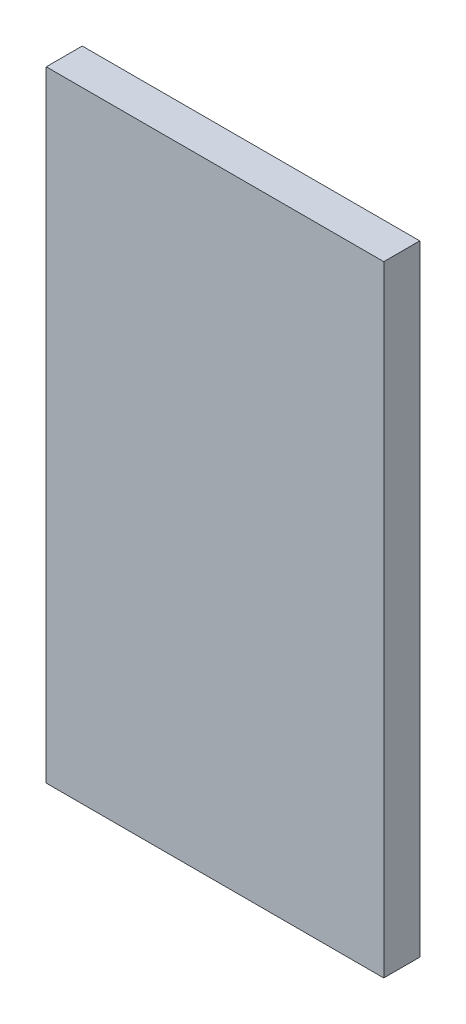
ISO-10303-21;
HEADER;
FILE_DESCRIPTION(('STEP AP214'),'2;1');
FILE_NAME('part.step','',(''),(''),'','','');
FILE_SCHEMA(('AUTOMOTIVE_DESIGN { 1 0 10303 214 1 1 1 1 }'));
ENDSEC;
DATA;
#1=APPLICATION_CONTEXT('core data for automotive mechanical design processes');
#2=APPLICATION_PROTOCOL_DEFINITION('international standard','automotive_design',2000,#1);
#3=PRODUCT_CONTEXT('',#1,'mechanical');
#4=PRODUCT('Part','Part','',(#3));
#5=PRODUCT_RELATED_PRODUCT_CATEGORY('part','',(#4));
#6=PRODUCT_DEFINITION_FORMATION('','',#4);
#7=PRODUCT_DEFINITION_CONTEXT('part definition',#1,'design');
#8=PRODUCT_DEFINITION('design','',#6,#7);
#9=PRODUCT_DEFINITION_SHAPE('','',#8);
#10=(LENGTH_UNIT() NAMED_UNIT(*) SI_UNIT(.MILLI.,.METRE.));
#11=(NAMED_UNIT(*) PLANE_ANGLE_UNIT() SI_UNIT($,.RADIAN.));
#12=(NAMED_UNIT(*) SI_UNIT($,.STERADIAN.) SOLID_ANGLE_UNIT());
#13=UNCERTAINTY_MEASURE_WITH_UNIT(LENGTH_MEASURE(1.E-05),#10,'distance_accuracy_value','');
#14=(GEOMETRIC_REPRESENTATION_CONTEXT(3) GLOBAL_UNCERTAINTY_ASSIGNED_CONTEXT((#13)) GLOBAL_UNIT_ASSIGNED_CONTEXT((#10,
#11,#12)) REPRESENTATION_CONTEXT('',''));
#15=CARTESIAN_POINT('',(0.,0.,0.));
#16=DIRECTION('',(0.,0.,1.));
#17=DIRECTION('',(1.,0.,0.));
#18=AXIS2_PLACEMENT_3D('',#15,#16,#17);
#19=CARTESIAN_POINT('',(-0.29999686,0.55144416,0.06399784));
#20=DIRECTION('',(0.,0.,-1.));
#21=DIRECTION('',(-1.,0.,0.));
#22=AXIS2_PLACEMENT_3D('',#19,#20,#21);
#23=PLANE('',#22);
#24=DIRECTION('',(1.,0.,0.));
#25=VECTOR('',#24,1.);
#26=CARTESIAN_POINT('',(-0.29999686,-0.55144162,0.06399784));
#27=LINE('',#26,#25);
#28=CARTESIAN_POINT('',(-0.29999686,-0.55144162,0.06399784));
#29=VERTEX_POINT('',#28);
#30=CARTESIAN_POINT('',(0.29999686,-0.55144162,0.06399784));
#31=VERTEX_POINT('',#30);
#32=EDGE_CURVE('E54',#29,#31,#27,.T.);
#33=ORIENTED_EDGE('',*,*,#32,.T.);
#34=DIRECTION('',(0.,1.,0.));
#35=VECTOR('',#34,1.);
#36=CARTESIAN_POINT('',(0.29999686,-0.55144162,0.06399784));
#37=LINE('',#36,#35);
#38=CARTESIAN_POINT('',(0.29999686,0.55144416,0.06399784));
#39=VERTEX_POINT('',#38);
#40=EDGE_CURVE('E56',#31,#39,#37,.T.);
#41=ORIENTED_EDGE('',*,*,#40,.T.);
#42=DIRECTION('',(1.,0.,0.));
#43=VECTOR('',#42,1.);
#44=CARTESIAN_POINT('',(0.29999686,0.55144416,0.06399784));
#45=LINE('',#44,#43);
#46=CARTESIAN_POINT('',(-0.29999686,0.55144416,0.06399784));
#47=VERTEX_POINT('',#46);
#48=EDGE_CURVE('E19',#39,#47,#45,.F.);
#49=ORIENTED_EDGE('',*,*,#48,.T.);
#50=DIRECTION('',(0.,1.,0.));
#51=VECTOR('',#50,1.);
#52=CARTESIAN_POINT('',(-0.29999686,0.55144416,0.06399784));
#53=LINE('',#52,#51);
#54=EDGE_CURVE('E79',#47,#29,#53,.F.);
#55=ORIENTED_EDGE('',*,*,#54,.T.);
#56=EDGE_LOOP('',(#33,#41,#49,#55));
#57=FACE_BOUND('',#56,.T.);
#58=ADVANCED_FACE('F16',(#57),#23,.F.);
#59=CARTESIAN_POINT('',(0.29999686,0.55144416,0.));
#60=DIRECTION('',(0.,-1.,0.));
#61=DIRECTION('',(0.,0.,-1.));
#62=AXIS2_PLACEMENT_3D('',#59,#60,#61);
#63=PLANE('',#62);
#64=DIRECTION('',(0.,0.,-1.));
#65=VECTOR('',#64,1.);
#66=CARTESIAN_POINT('',(-0.29999686,0.55144416,0.));
#67=LINE('',#66,#65);
#68=CARTESIAN_POINT('',(-0.29999686,0.55144416,0.));
#69=VERTEX_POINT('',#68);
#70=EDGE_CURVE('E67',#69,#47,#67,.F.);
#71=ORIENTED_EDGE('',*,*,#70,.T.);
#72=ORIENTED_EDGE('',*,*,#48,.F.);
#73=DIRECTION('',(0.,0.,1.));
#74=VECTOR('',#73,1.);
#75=CARTESIAN_POINT('',(0.29999686,0.55144416,0.));
#76=LINE('',#75,#74);
#77=CARTESIAN_POINT('',(0.29999686,0.55144416,0.));
#78=VERTEX_POINT('',#77);
#79=EDGE_CURVE('E62',#39,#78,#76,.F.);
#80=ORIENTED_EDGE('',*,*,#79,.T.);
#81=DIRECTION('',(-1.,0.,0.));
#82=VECTOR('',#81,1.);
#83=CARTESIAN_POINT('',(-0.29999686,0.55144416,0.));
#84=LINE('',#83,#82);
#85=EDGE_CURVE('E82',#69,#78,#84,.F.);
#86=ORIENTED_EDGE('',*,*,#85,.F.);
#87=EDGE_LOOP('',(#71,#72,#80,#86));
#88=FACE_BOUND('',#87,.T.);
#89=ADVANCED_FACE('F64',(#88),#63,.F.);
#90=CARTESIAN_POINT('',(0.29999686,-0.55144162,0.));
#91=DIRECTION('',(-1.,0.,0.));
#92=DIRECTION('',(0.,0.,1.));
#93=AXIS2_PLACEMENT_3D('',#90,#91,#92);
#94=PLANE('',#93);
#95=ORIENTED_EDGE('',*,*,#79,.F.);
#96=ORIENTED_EDGE('',*,*,#40,.F.);
#97=DIRECTION('',(0.,0.,1.));
#98=VECTOR('',#97,1.);
#99=CARTESIAN_POINT('',(0.29999686,-0.55144162,0.));
#100=LINE('',#99,#98);
#101=CARTESIAN_POINT('',(0.29999686,-0.55144162,0.));
#102=VERTEX_POINT('',#101);
#103=EDGE_CURVE('E74',#31,#102,#100,.F.);
#104=ORIENTED_EDGE('',*,*,#103,.T.);
#105=DIRECTION('',(0.,1.,0.));
#106=VECTOR('',#105,1.);
#107=CARTESIAN_POINT('',(0.29999686,0.55144416,0.));
#108=LINE('',#107,#106);
#109=EDGE_CURVE('E71',#78,#102,#108,.F.);
#110=ORIENTED_EDGE('',*,*,#109,.F.);
#111=EDGE_LOOP('',(#95,#96,#104,#110));
#112=FACE_BOUND('',#111,.T.);
#113=ADVANCED_FACE('F69',(#112),#94,.F.);
#114=CARTESIAN_POINT('',(-0.29999686,-0.55144162,0.));
#115=DIRECTION('',(0.,1.,0.));
#116=DIRECTION('',(0.,0.,1.));
#117=AXIS2_PLACEMENT_3D('',#114,#115,#116);
#118=PLANE('',#117);
#119=ORIENTED_EDGE('',*,*,#103,.F.);
#120=ORIENTED_EDGE('',*,*,#32,.F.);
#121=DIRECTION('',(0.,0.,-1.));
#122=VECTOR('',#121,1.);
#123=CARTESIAN_POINT('',(-0.29999686,-0.55144162,0.));
#124=LINE('',#123,#122);
#125=CARTESIAN_POINT('',(-0.29999686,-0.55144162,0.));
#126=VERTEX_POINT('',#125);
#127=EDGE_CURVE('E34',#29,#126,#124,.T.);
#128=ORIENTED_EDGE('',*,*,#127,.T.);
#129=DIRECTION('',(-1.,0.,0.));
#130=VECTOR('',#129,1.);
#131=CARTESIAN_POINT('',(-0.29999686,-0.55144162,0.));
#132=LINE('',#131,#130);
#133=EDGE_CURVE('E25',#102,#126,#132,.T.);
#134=ORIENTED_EDGE('',*,*,#133,.F.);
#135=EDGE_LOOP('',(#119,#120,#128,#134));
#136=FACE_BOUND('',#135,.T.);
#137=ADVANCED_FACE('F88',(#136),#118,.F.);
#138=CARTESIAN_POINT('',(-0.29999686,0.55144416,0.));
#139=DIRECTION('',(1.,0.,0.));
#140=DIRECTION('',(0.,0.,-1.));
#141=AXIS2_PLACEMENT_3D('',#138,#139,#140);
#142=PLANE('',#141);
#143=ORIENTED_EDGE('',*,*,#127,.F.);
#144=ORIENTED_EDGE('',*,*,#54,.F.);
#145=ORIENTED_EDGE('',*,*,#70,.F.);
#146=DIRECTION('',(0.,1.,0.));
#147=VECTOR('',#146,1.);
#148=CARTESIAN_POINT('',(-0.29999686,0.55144416,0.));
#149=LINE('',#148,#147);
#150=EDGE_CURVE('E11',#126,#69,#149,.T.);
#151=ORIENTED_EDGE('',*,*,#150,.F.);
#152=EDGE_LOOP('',(#143,#144,#145,#151));
#153=FACE_BOUND('',#152,.T.);
#154=ADVANCED_FACE('F90',(#153),#142,.F.);
#155=CARTESIAN_POINT('',(-0.29999686,0.55144416,0.));
#156=DIRECTION('',(0.,0.,-1.));
#157=DIRECTION('',(-1.,0.,0.));
#158=AXIS2_PLACEMENT_3D('',#155,#156,#157);
#159=PLANE('',#158);
#160=ORIENTED_EDGE('',*,*,#133,.T.);
#161=ORIENTED_EDGE('',*,*,#150,.T.);
#162=ORIENTED_EDGE('',*,*,#85,.T.);
#163=ORIENTED_EDGE('',*,*,#109,.T.);
#164=EDGE_LOOP('',(#160,#161,#162,#163));
#165=FACE_BOUND('',#164,.T.);
#166=ADVANCED_FACE('F87',(#165),#159,.T.);
#167=CLOSED_SHELL('',(#58,#89,#113,#137,#154,#166));
#168=MANIFOLD_SOLID_BREP('B1',#167);
#169=ADVANCED_BREP_SHAPE_REPRESENTATION('',(#18,#168),#14);
#170=SHAPE_DEFINITION_REPRESENTATION(#9,#169);
ENDSEC;
END-ISO-10303-21;
